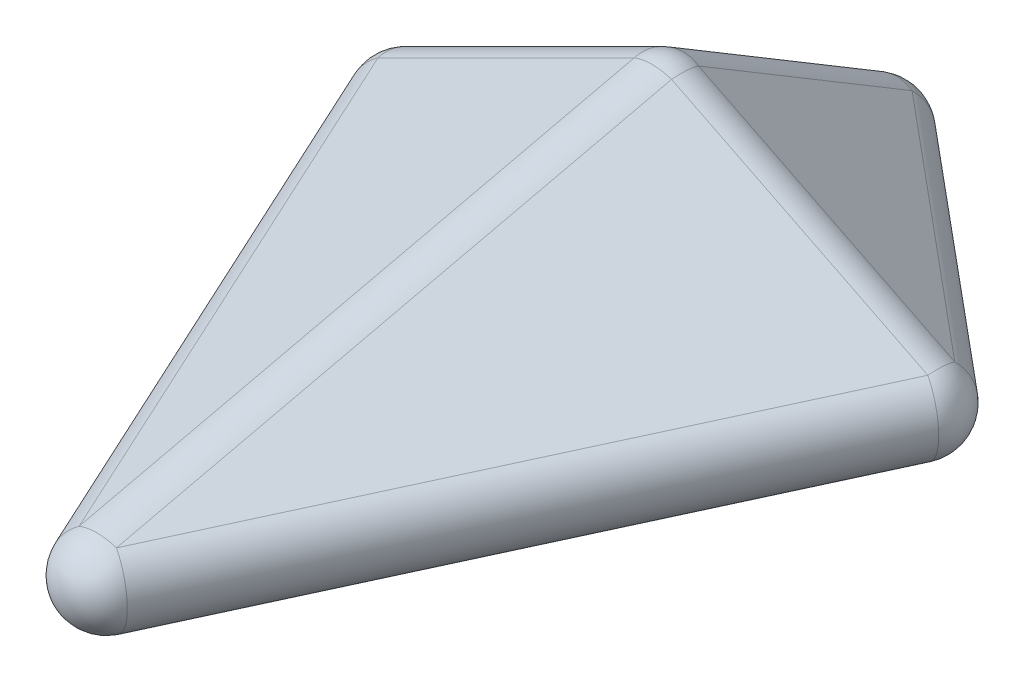
ISO-10303-21;
HEADER;
FILE_DESCRIPTION(('STEP AP214'),'2;1');
FILE_NAME('part.step','',(''),(''),'','','');
FILE_SCHEMA(('AUTOMOTIVE_DESIGN { 1 0 10303 214 1 1 1 1 }'));
ENDSEC;
DATA;
#1=APPLICATION_CONTEXT('core data for automotive mechanical design processes');
#2=APPLICATION_PROTOCOL_DEFINITION('international standard','automotive_design',2000,#1);
#3=PRODUCT_CONTEXT('',#1,'mechanical');
#4=PRODUCT('Part','Part','',(#3));
#5=PRODUCT_RELATED_PRODUCT_CATEGORY('part','',(#4));
#6=PRODUCT_DEFINITION_FORMATION('','',#4);
#7=PRODUCT_DEFINITION_CONTEXT('part definition',#1,'design');
#8=PRODUCT_DEFINITION('design','',#6,#7);
#9=PRODUCT_DEFINITION_SHAPE('','',#8);
#10=(LENGTH_UNIT() NAMED_UNIT(*) SI_UNIT(.MILLI.,.METRE.));
#11=(NAMED_UNIT(*) PLANE_ANGLE_UNIT() SI_UNIT($,.RADIAN.));
#12=(NAMED_UNIT(*) SI_UNIT($,.STERADIAN.) SOLID_ANGLE_UNIT());
#13=UNCERTAINTY_MEASURE_WITH_UNIT(LENGTH_MEASURE(1.E-05),#10,'distance_accuracy_value','');
#14=(GEOMETRIC_REPRESENTATION_CONTEXT(3) GLOBAL_UNCERTAINTY_ASSIGNED_CONTEXT((#13)) GLOBAL_UNIT_ASSIGNED_CONTEXT((#10,
#11,#12)) REPRESENTATION_CONTEXT('',''));
#15=CARTESIAN_POINT('',(0.,0.,0.));
#16=DIRECTION('',(0.,0.,1.));
#17=DIRECTION('',(1.,0.,0.));
#18=AXIS2_PLACEMENT_3D('',#15,#16,#17);
#19=CARTESIAN_POINT('',(-177.732540056397,140.344288770225,346.44378338033));
#20=DIRECTION('',(-0.39405520311955,0.788110406239101,-0.47286624374346));
#21=DIRECTION('',(0.,0.514495755427526,0.857492925712544));
#22=AXIS2_PLACEMENT_3D('',#19,#20,#21);
#23=PLANE('',#22);
#24=DIRECTION('',(0.894427190999916,0.447213595499958,0.));
#25=VECTOR('',#24,1.);
#26=CARTESIAN_POINT('',(0.383625189944573,20.1175026339666,-2.3643312187173));
#27=LINE('',#26,#25);
#28=CARTESIAN_POINT('',(-31.9702760155978,3.94055203119549,-2.36433121871729));
#29=VERTEX_POINT('',#28);
#30=CARTESIAN_POINT('',(-1.9702760155978,18.9405520311954,-2.3643312187173));
#31=VERTEX_POINT('',#30);
#32=EDGE_CURVE('E60',#29,#31,#27,.T.);
#33=ORIENTED_EDGE('',*,*,#32,.T.);
#34=DIRECTION('',(0.,-0.514495755427526,-0.857492925712544));
#35=VECTOR('',#34,1.);
#36=CARTESIAN_POINT('',(-1.9702760155978,3.21618584899045,-28.571608189059));
#37=LINE('',#36,#35);
#38=CARTESIAN_POINT('',(-1.97027601559779,3.94055203119551,-27.3643312187173));
#39=VERTEX_POINT('',#38);
#40=EDGE_CURVE('E255',#31,#39,#37,.T.);
#41=ORIENTED_EDGE('',*,*,#40,.T.);
#42=DIRECTION('',(0.768221279597376,0.,-0.64018439966448));
#43=VECTOR('',#42,1.);
#44=CARTESIAN_POINT('',(-289.538881645765,3.94055203119553,212.276173473088));
#45=LINE('',#44,#43);
#46=EDGE_CURVE('E210',#39,#29,#45,.F.);
#47=ORIENTED_EDGE('',*,*,#46,.T.);
#48=EDGE_LOOP('',(#33,#41,#47));
#49=FACE_BOUND('',#48,.T.);
#50=ADVANCED_FACE('F37',(#49),#23,.T.);
#51=CARTESIAN_POINT('',(-177.732540056397,-94.9705115084293,346.44378338033));
#52=DIRECTION('',(-0.295656197994541,-0.886968593983624,-0.35478743759345));
#53=DIRECTION('',(0.,0.371390676354104,-0.928476690885259));
#54=AXIS2_PLACEMENT_3D('',#51,#52,#53);
#55=PLANE('',#54);
#56=DIRECTION('',(0.768221279597376,0.,-0.64018439966448));
#57=VECTOR('',#56,1.);
#58=CARTESIAN_POINT('',(-289.04688662014,-4.4348429699182,212.866567503839));
#59=LINE('',#58,#57);
#60=CARTESIAN_POINT('',(-31.4782809899727,-4.43484296991818,-1.77393718796715));
#61=VERTEX_POINT('',#60);
#62=CARTESIAN_POINT('',(-1.47828098997266,-4.43484296991817,-26.7739371879672));
#63=VERTEX_POINT('',#62);
#64=EDGE_CURVE('E203',#61,#63,#59,.T.);
#65=ORIENTED_EDGE('',*,*,#64,.T.);
#66=DIRECTION('',(0.,-0.371390676354104,0.928476690885259));
#67=VECTOR('',#66,1.);
#68=CARTESIAN_POINT('',(-1.47828098997274,-14.9878631566111,-0.391386721234837));
#69=LINE('',#68,#67);
#70=CARTESIAN_POINT('',(-1.47828098997274,-14.4348429699181,-1.7739371879672));
#71=VERTEX_POINT('',#70);
#72=EDGE_CURVE('E165',#63,#71,#69,.T.);
#73=ORIENTED_EDGE('',*,*,#72,.T.);
#74=DIRECTION('',(-0.948683298050514,0.316227766016838,0.));
#75=VECTOR('',#74,1.);
#76=CARTESIAN_POINT('',(-32.0113897256416,-4.25714005802852,-1.77393718796721));
#77=LINE('',#76,#75);
#78=EDGE_CURVE('E231',#71,#61,#77,.T.);
#79=ORIENTED_EDGE('',*,*,#78,.T.);
#80=EDGE_LOOP('',(#65,#73,#79));
#81=FACE_BOUND('',#80,.T.);
#82=ADVANCED_FACE('F300',(#81),#55,.T.);
#83=CARTESIAN_POINT('',(219.623560570026,69.5541623383291,264.184381235056));
#84=DIRECTION('',(0.437981128343986,-0.875962256687972,-0.202145136158763));
#85=DIRECTION('',(0.894427190999916,0.447213595499958,0.));
#86=AXIS2_PLACEMENT_3D('',#83,#84,#85);
#87=PLANE('',#86);
#88=DIRECTION('',(0.,0.224859506698758,-0.97439119569462));
#89=VECTOR('',#88,1.);
#90=CARTESIAN_POINT('',(-2.18990564171989,19.8451629760729,-1.00579832061622));
#91=LINE('',#90,#89);
#92=CARTESIAN_POINT('',(-2.18990564171997,4.37981128343983,66.0107256807937));
#93=VERTEX_POINT('',#92);
#94=CARTESIAN_POINT('',(-2.1899056417199,19.3798112834399,1.01072568079381));
#95=VERTEX_POINT('',#94);
#96=EDGE_CURVE('E46',#93,#95,#91,.T.);
#97=ORIENTED_EDGE('',*,*,#96,.T.);
#98=DIRECTION('',(0.894427190999916,0.447213595499958,0.));
#99=VECTOR('',#98,1.);
#100=CARTESIAN_POINT('',(-32.8458878970093,4.05182015579515,1.01072568079379));
#101=LINE('',#100,#99);
#102=CARTESIAN_POINT('',(-32.1899056417199,4.37981128343983,1.0107256807938));
#103=VERTEX_POINT('',#102);
#104=EDGE_CURVE('E11',#95,#103,#101,.F.);
#105=ORIENTED_EDGE('',*,*,#104,.T.);
#106=DIRECTION('',(-0.419058177461747,0.,-0.907959384500452));
#107=VECTOR('',#106,1.);
#108=CARTESIAN_POINT('',(112.165362245379,4.37981128343984,313.780472769509));
#109=LINE('',#108,#107);
#110=EDGE_CURVE('E214',#103,#93,#109,.F.);
#111=ORIENTED_EDGE('',*,*,#110,.T.);
#112=EDGE_LOOP('',(#97,#105,#111));
#113=FACE_BOUND('',#112,.T.);
#114=ADVANCED_FACE('F321',(#113),#87,.F.);
#115=CARTESIAN_POINT('',(103.439374315095,-0.912577845874646,317.807851814255));
#116=DIRECTION('',(0.312912531879412,0.938737595638237,-0.144421168559729));
#117=DIRECTION('',(-0.948683298050514,0.316227766016838,0.));
#118=AXIS2_PLACEMENT_3D('',#115,#116,#117);
#119=PLANE('',#118);
#120=DIRECTION('',(-0.419058177461747,0.,-0.907959384500452));
#121=VECTOR('',#120,1.);
#122=CARTESIAN_POINT('',(112.790705227702,-4.69368797819119,313.491852931514));
#123=LINE('',#122,#121);
#124=CARTESIAN_POINT('',(-1.56456265939707,-4.69368797819119,65.7221058427986));
#125=VERTEX_POINT('',#124);
#126=CARTESIAN_POINT('',(-31.564562659397,-4.69368797819119,0.722105842798748));
#127=VERTEX_POINT('',#126);
#128=EDGE_CURVE('E197',#125,#127,#123,.T.);
#129=ORIENTED_EDGE('',*,*,#128,.T.);
#130=DIRECTION('',(-0.948683298050514,0.316227766016838,0.));
#131=VECTOR('',#130,1.);
#132=CARTESIAN_POINT('',(0.0592343039632352,-15.2349536326446,0.722105842798693));
#133=LINE('',#132,#131);
#134=CARTESIAN_POINT('',(-1.56456265939706,-14.6936879781912,0.722105842798692));
#135=VERTEX_POINT('',#134);
#136=EDGE_CURVE('E240',#127,#135,#133,.F.);
#137=ORIENTED_EDGE('',*,*,#136,.T.);
#138=DIRECTION('',(0.,0.152057184253941,0.988371697650617));
#139=VECTOR('',#138,1.);
#140=CARTESIAN_POINT('',(-1.56456265939707,-4.18422537811778,69.0336127432758));
#141=LINE('',#140,#139);
#142=EDGE_CURVE('E238',#135,#125,#141,.T.);
#143=ORIENTED_EDGE('',*,*,#142,.T.);
#144=EDGE_LOOP('',(#129,#137,#143));
#145=FACE_BOUND('',#144,.T.);
#146=ADVANCED_FACE('F324',(#145),#119,.F.);
#147=CARTESIAN_POINT('',(180.765255366117,140.344288770225,348.97104613843));
#148=DIRECTION('',(-0.39405520311955,-0.788110406239101,0.47286624374346));
#149=DIRECTION('',(0.,-0.514495755427526,-0.857492925712544));
#150=AXIS2_PLACEMENT_3D('',#147,#148,#149);
#151=PLANE('',#150);
#152=DIRECTION('',(0.,-0.514495755427526,-0.857492925712544));
#153=VECTOR('',#152,1.);
#154=CARTESIAN_POINT('',(1.97027601559772,20.1603868316507,-0.331273217958627));
#155=LINE('',#154,#153);
#156=CARTESIAN_POINT('',(1.97027601559779,3.9405520311955,-27.3643312187173));
#157=VERTEX_POINT('',#156);
#158=CARTESIAN_POINT('',(1.97027601559771,18.9405520311955,-2.36433121871724));
#159=VERTEX_POINT('',#158);
#160=EDGE_CURVE('E246',#157,#159,#155,.F.);
#161=ORIENTED_EDGE('',*,*,#160,.T.);
#162=DIRECTION('',(0.894427190999916,-0.447213595499958,0.));
#163=VECTOR('',#162,1.);
#164=CARTESIAN_POINT('',(32.6262582708872,3.61256090355078,-2.36433121871727));
#165=LINE('',#164,#163);
#166=CARTESIAN_POINT('',(31.9702760155978,3.94055203119549,-2.36433121871725));
#167=VERTEX_POINT('',#166);
#168=EDGE_CURVE('E248',#159,#167,#165,.T.);
#169=ORIENTED_EDGE('',*,*,#168,.T.);
#170=DIRECTION('',(-0.768221279597376,0.,-0.64018439966448));
#171=VECTOR('',#170,1.);
#172=CARTESIAN_POINT('',(292.571596955485,3.94055203119548,214.803436231188));
#173=LINE('',#172,#171);
#174=EDGE_CURVE('E150',#167,#157,#173,.T.);
#175=ORIENTED_EDGE('',*,*,#174,.T.);
#176=EDGE_LOOP('',(#161,#169,#175));
#177=FACE_BOUND('',#176,.T.);
#178=ADVANCED_FACE('F327',(#177),#151,.F.);
#179=CARTESIAN_POINT('',(180.765255366117,-94.9705115084293,348.97104613843));
#180=DIRECTION('',(-0.295656197994541,0.886968593983624,0.354787437593449));
#181=DIRECTION('',(0.,-0.371390676354104,0.928476690885259));
#182=AXIS2_PLACEMENT_3D('',#179,#180,#181);
#183=PLANE('',#182);
#184=DIRECTION('',(-0.768221279597376,0.,-0.640184399664479));
#185=VECTOR('',#184,1.);
#186=CARTESIAN_POINT('',(292.07960192986,-4.43484296991814,215.393830261939));
#187=LINE('',#186,#185);
#188=CARTESIAN_POINT('',(1.47828098997266,-4.43484296991814,-26.7739371879672));
#189=VERTEX_POINT('',#188);
#190=CARTESIAN_POINT('',(31.4782809899726,-4.43484296991814,-1.77393718796726));
#191=VERTEX_POINT('',#190);
#192=EDGE_CURVE('E132',#189,#191,#187,.F.);
#193=ORIENTED_EDGE('',*,*,#192,.T.);
#194=DIRECTION('',(-0.948683298050514,-0.316227766016838,0.));
#195=VECTOR('',#194,1.);
#196=CARTESIAN_POINT('',(-0.145515973387585,-14.9761086243715,-1.77393718796719));
#197=LINE('',#196,#195);
#198=CARTESIAN_POINT('',(1.47828098997267,-14.4348429699181,-1.77393718796719));
#199=VERTEX_POINT('',#198);
#200=EDGE_CURVE('E135',#191,#199,#197,.T.);
#201=ORIENTED_EDGE('',*,*,#200,.T.);
#202=DIRECTION('',(0.,-0.371390676354104,0.928476690885259));
#203=VECTOR('',#202,1.);
#204=CARTESIAN_POINT('',(1.47828098997267,-4.01004958199498,-27.8359206577751));
#205=LINE('',#204,#203);
#206=EDGE_CURVE('E129',#199,#189,#205,.F.);
#207=ORIENTED_EDGE('',*,*,#206,.T.);
#208=EDGE_LOOP('',(#193,#201,#207));
#209=FACE_BOUND('',#208,.T.);
#210=ADVANCED_FACE('F131',(#209),#183,.F.);
#211=CARTESIAN_POINT('',(-295.522276845683,69.5541623383291,428.631599832314));
#212=DIRECTION('',(0.437981128343986,0.875962256687972,0.202145136158763));
#213=DIRECTION('',(-0.894427190999916,0.447213595499958,0.));
#214=AXIS2_PLACEMENT_3D('',#211,#212,#213);
#215=PLANE('',#214);
#216=DIRECTION('',(0.419058177461747,0.,-0.907959384500452));
#217=VECTOR('',#216,1.);
#218=CARTESIAN_POINT('',(-188.064078521036,4.37981128343987,478.227691366766));
#219=LINE('',#218,#217);
#220=CARTESIAN_POINT('',(2.18990564171995,4.37981128343988,66.0107256807937));
#221=VERTEX_POINT('',#220);
#222=CARTESIAN_POINT('',(32.1899056417199,4.37981128343988,1.0107256807938));
#223=VERTEX_POINT('',#222);
#224=EDGE_CURVE('E149',#221,#223,#219,.T.);
#225=ORIENTED_EDGE('',*,*,#224,.T.);
#226=DIRECTION('',(0.894427190999916,-0.447213595499958,0.));
#227=VECTOR('',#226,1.);
#228=CARTESIAN_POINT('',(-0.163995563822332,20.556761886211,1.01072568079388));
#229=LINE('',#228,#227);
#230=CARTESIAN_POINT('',(2.18990564171995,19.3798112834398,1.01072568079388));
#231=VERTEX_POINT('',#230);
#232=EDGE_CURVE('E252',#223,#231,#229,.F.);
#233=ORIENTED_EDGE('',*,*,#232,.T.);
#234=DIRECTION('',(0.,0.224859506698758,-0.97439119569462));
#235=VECTOR('',#234,1.);
#236=CARTESIAN_POINT('',(2.18990564171996,3.34022124565713,70.515615844519));
#237=LINE('',#236,#235);
#238=EDGE_CURVE('E250',#231,#221,#237,.F.);
#239=ORIENTED_EDGE('',*,*,#238,.T.);
#240=EDGE_LOOP('',(#225,#233,#239));
#241=FACE_BOUND('',#240,.T.);
#242=ADVANCED_FACE('F332',(#241),#215,.T.);
#243=CARTESIAN_POINT('',(-179.338090590752,-0.912577845874646,482.255070411513));
#244=DIRECTION('',(0.312912531879412,-0.938737595638237,0.144421168559729));
#245=DIRECTION('',(0.948683298050514,0.316227766016838,0.));
#246=AXIS2_PLACEMENT_3D('',#243,#244,#245);
#247=PLANE('',#246);
#248=DIRECTION('',(0.,0.152057184253941,0.988371697650617));
#249=VECTOR('',#248,1.);
#250=CARTESIAN_POINT('',(1.56456265939706,-14.9031939444608,-0.639682937954016));
#251=LINE('',#250,#249);
#252=CARTESIAN_POINT('',(1.56456265939708,-4.69368797819118,65.7221058427986));
#253=VERTEX_POINT('',#252);
#254=CARTESIAN_POINT('',(1.56456265939706,-14.6936879781912,0.722105842798704));
#255=VERTEX_POINT('',#254);
#256=EDGE_CURVE('E222',#253,#255,#251,.F.);
#257=ORIENTED_EDGE('',*,*,#256,.T.);
#258=DIRECTION('',(-0.948683298050514,-0.316227766016838,0.));
#259=VECTOR('',#258,1.);
#260=CARTESIAN_POINT('',(32.0976713950659,-4.51598506630156,0.722105842798691));
#261=LINE('',#260,#259);
#262=CARTESIAN_POINT('',(31.5645626593971,-4.69368797819117,0.722105842798582));
#263=VERTEX_POINT('',#262);
#264=EDGE_CURVE('E224',#255,#263,#261,.F.);
#265=ORIENTED_EDGE('',*,*,#264,.T.);
#266=DIRECTION('',(0.419058177461747,0.,-0.907959384500452));
#267=VECTOR('',#266,1.);
#268=CARTESIAN_POINT('',(-188.689421503359,-4.69368797819121,477.939071528771));
#269=LINE('',#268,#267);
#270=EDGE_CURVE('E139',#263,#253,#269,.F.);
#271=ORIENTED_EDGE('',*,*,#270,.T.);
#272=EDGE_LOOP('',(#257,#265,#271));
#273=FACE_BOUND('',#272,.T.);
#274=ADVANCED_FACE('F278',(#273),#247,.T.);
#275=CARTESIAN_POINT('',(290.601320939887,0.,217.167767449906));
#276=DIRECTION('',(-0.768221279597376,0.,-0.640184399664479));
#277=DIRECTION('',(-0.64018439966448,0.,0.768221279597376));
#278=AXIS2_PLACEMENT_3D('',#275,#276,#277);
#279=CYLINDRICAL_SURFACE('',#278,5.);
#280=ORIENTED_EDGE('',*,*,#174,.F.);
#281=CARTESIAN_POINT('',(29.9999999999999,0.,0.));
#282=DIRECTION('',(-0.768221279597376,0.,-0.640184399664479));
#283=DIRECTION('',(-0.64018439966448,0.,0.768221279597376));
#284=AXIS2_PLACEMENT_3D('',#281,#282,#283);
#285=CIRCLE('',#284,5.);
#286=EDGE_CURVE('E148',#167,#191,#285,.T.);
#287=ORIENTED_EDGE('',*,*,#286,.T.);
#288=ORIENTED_EDGE('',*,*,#192,.F.);
#289=CARTESIAN_POINT('',(0.,0.,-24.9999999999999));
#290=DIRECTION('',(-0.768221279597376,0.,-0.640184399664479));
#291=DIRECTION('',(-0.64018439966448,0.,0.768221279597376));
#292=AXIS2_PLACEMENT_3D('',#289,#290,#291);
#293=CIRCLE('',#292,5.);
#294=EDGE_CURVE('E145',#189,#157,#293,.F.);
#295=ORIENTED_EDGE('',*,*,#294,.T.);
#296=EDGE_LOOP('',(#280,#287,#288,#295));
#297=FACE_BOUND('',#296,.T.);
#298=ADVANCED_FACE('F144',(#297),#279,.T.);
#299=CARTESIAN_POINT('',(-190.253984162756,0.,477.216965685972));
#300=DIRECTION('',(0.419058177461747,0.,-0.907959384500452));
#301=DIRECTION('',(-0.907959384500452,0.,-0.419058177461747));
#302=AXIS2_PLACEMENT_3D('',#299,#300,#301);
#303=CYLINDRICAL_SURFACE('',#302,5.);
#304=ORIENTED_EDGE('',*,*,#270,.F.);
#305=CARTESIAN_POINT('',(29.9999999999999,0.,0.));
#306=DIRECTION('',(0.419058177461747,0.,-0.907959384500452));
#307=DIRECTION('',(-0.907959384500452,0.,-0.419058177461747));
#308=AXIS2_PLACEMENT_3D('',#305,#306,#307);
#309=CIRCLE('',#308,5.);
#310=EDGE_CURVE('E161',#263,#223,#309,.F.);
#311=ORIENTED_EDGE('',*,*,#310,.T.);
#312=ORIENTED_EDGE('',*,*,#224,.F.);
#313=CARTESIAN_POINT('',(0.,0.,65.));
#314=DIRECTION('',(0.419058177461747,0.,-0.907959384500452));
#315=DIRECTION('',(-0.907959384500452,0.,-0.419058177461747));
#316=AXIS2_PLACEMENT_3D('',#313,#314,#315);
#317=CIRCLE('',#316,5.);
#318=EDGE_CURVE('E227',#221,#253,#317,.T.);
#319=ORIENTED_EDGE('',*,*,#318,.T.);
#320=EDGE_LOOP('',(#304,#311,#312,#319));
#321=FACE_BOUND('',#320,.T.);
#322=ADVANCED_FACE('F282',(#321),#303,.T.);
#323=CARTESIAN_POINT('',(-287.568605630167,0.,214.640504691806));
#324=DIRECTION('',(0.768221279597376,0.,-0.64018439966448));
#325=DIRECTION('',(-0.64018439966448,0.,-0.768221279597376));
#326=AXIS2_PLACEMENT_3D('',#323,#324,#325);
#327=CYLINDRICAL_SURFACE('',#326,5.);
#328=ORIENTED_EDGE('',*,*,#46,.F.);
#329=CARTESIAN_POINT('',(0.,0.,-25.));
#330=DIRECTION('',(0.768221279597376,0.,-0.64018439966448));
#331=DIRECTION('',(-0.64018439966448,0.,-0.768221279597376));
#332=AXIS2_PLACEMENT_3D('',#329,#330,#331);
#333=CIRCLE('',#332,5.);
#334=EDGE_CURVE('E236',#39,#63,#333,.F.);
#335=ORIENTED_EDGE('',*,*,#334,.T.);
#336=ORIENTED_EDGE('',*,*,#64,.F.);
#337=CARTESIAN_POINT('',(-30.,0.,0.));
#338=DIRECTION('',(0.768221279597376,0.,-0.64018439966448));
#339=DIRECTION('',(-0.64018439966448,0.,-0.768221279597376));
#340=AXIS2_PLACEMENT_3D('',#337,#338,#339);
#341=CIRCLE('',#340,5.);
#342=EDGE_CURVE('E234',#61,#29,#341,.T.);
#343=ORIENTED_EDGE('',*,*,#342,.T.);
#344=EDGE_LOOP('',(#328,#335,#336,#343));
#345=FACE_BOUND('',#344,.T.);
#346=ADVANCED_FACE('F303',(#345),#327,.T.);
#347=CARTESIAN_POINT('',(114.355267887099,0.,312.769747088715));
#348=DIRECTION('',(-0.419058177461747,0.,-0.907959384500452));
#349=DIRECTION('',(-0.907959384500452,0.,0.419058177461747));
#350=AXIS2_PLACEMENT_3D('',#347,#348,#349);
#351=CYLINDRICAL_SURFACE('',#350,5.);
#352=ORIENTED_EDGE('',*,*,#110,.F.);
#353=CARTESIAN_POINT('',(-30.,0.,0.));
#354=DIRECTION('',(-0.419058177461747,0.,-0.907959384500452));
#355=DIRECTION('',(-0.907959384500452,0.,0.419058177461747));
#356=AXIS2_PLACEMENT_3D('',#353,#354,#355);
#357=CIRCLE('',#356,5.);
#358=EDGE_CURVE('E244',#103,#127,#357,.F.);
#359=ORIENTED_EDGE('',*,*,#358,.T.);
#360=ORIENTED_EDGE('',*,*,#128,.F.);
#361=CARTESIAN_POINT('',(0.,0.,65.));
#362=DIRECTION('',(-0.419058177461747,0.,-0.907959384500452));
#363=DIRECTION('',(-0.907959384500452,0.,0.419058177461747));
#364=AXIS2_PLACEMENT_3D('',#361,#362,#363);
#365=CIRCLE('',#364,5.);
#366=EDGE_CURVE('E242',#125,#93,#365,.T.);
#367=ORIENTED_EDGE('',*,*,#366,.T.);
#368=EDGE_LOOP('',(#352,#359,#360,#367));
#369=FACE_BOUND('',#368,.T.);
#370=ADVANCED_FACE('F307',(#369),#351,.T.);
#371=CARTESIAN_POINT('',(-92.0483165370272,-31.0241582685136,0.));
#372=DIRECTION('',(-0.894427190999916,-0.447213595499958,0.));
#373=DIRECTION('',(0.447213595499958,-0.894427190999916,0.));
#374=AXIS2_PLACEMENT_3D('',#371,#372,#373);
#375=CYLINDRICAL_SURFACE('',#374,5.);
#376=CARTESIAN_POINT('',(-30.,0.,0.));
#377=DIRECTION('',(-0.894427190999916,-0.447213595499958,0.));
#378=DIRECTION('',(0.447213595499958,-0.894427190999916,0.));
#379=AXIS2_PLACEMENT_3D('',#376,#377,#378);
#380=CIRCLE('',#379,5.);
#381=EDGE_CURVE('E41',#103,#29,#380,.T.);
#382=ORIENTED_EDGE('',*,*,#381,.F.);
#383=ORIENTED_EDGE('',*,*,#104,.F.);
#384=CARTESIAN_POINT('',(0.,14.9999999999999,0.));
#385=DIRECTION('',(0.894427190999922,0.447213595499945,0.));
#386=DIRECTION('',(-0.447213595499945,0.894427190999922,0.));
#387=AXIS2_PLACEMENT_3D('',#384,#385,#386);
#388=CIRCLE('',#387,5.);
#389=EDGE_CURVE('E191',#31,#95,#388,.T.);
#390=ORIENTED_EDGE('',*,*,#389,.F.);
#391=ORIENTED_EDGE('',*,*,#32,.F.);
#392=EDGE_LOOP('',(#382,#383,#390,#391));
#393=FACE_BOUND('',#392,.T.);
#394=ADVANCED_FACE('F39',(#393),#375,.T.);
#395=CARTESIAN_POINT('',(0.,15.,0.));
#396=DIRECTION('',(0.,0.,1.));
#397=DIRECTION('',(1.,0.,0.));
#398=AXIS2_PLACEMENT_3D('',#395,#396,#397);
#399=SPHERICAL_SURFACE('',#398,5.);
#400=CARTESIAN_POINT('',(0.,15.,0.));
#401=DIRECTION('',(0.,0.224859506698766,-0.974391195694618));
#402=DIRECTION('',(0.,0.974391195694618,0.224859506698766));
#403=AXIS2_PLACEMENT_3D('',#400,#401,#402);
#404=CIRCLE('',#403,5.);
#405=EDGE_CURVE('E183',#231,#95,#404,.F.);
#406=ORIENTED_EDGE('',*,*,#405,.F.);
#407=CARTESIAN_POINT('',(0.,15.,0.));
#408=DIRECTION('',(-0.894427190999918,0.447213595499954,0.));
#409=DIRECTION('',(-0.447213595499954,-0.894427190999918,0.));
#410=AXIS2_PLACEMENT_3D('',#407,#408,#409);
#411=CIRCLE('',#410,5.);
#412=EDGE_CURVE('E189',#159,#231,#411,.F.);
#413=ORIENTED_EDGE('',*,*,#412,.F.);
#414=CARTESIAN_POINT('',(0.,15.,0.));
#415=DIRECTION('',(0.,0.514495755427534,0.85749292571254));
#416=DIRECTION('',(0.,-0.85749292571254,0.514495755427534));
#417=AXIS2_PLACEMENT_3D('',#414,#415,#416);
#418=CIRCLE('',#417,5.);
#419=EDGE_CURVE('E186',#31,#159,#418,.F.);
#420=ORIENTED_EDGE('',*,*,#419,.F.);
#421=ORIENTED_EDGE('',*,*,#389,.T.);
#422=EDGE_LOOP('',(#406,#413,#420,#421));
#423=FACE_BOUND('',#422,.T.);
#424=ADVANCED_FACE('F311',(#423),#399,.T.);
#425=CARTESIAN_POINT('',(94.4744887848032,-32.2372443924016,0.));
#426=DIRECTION('',(-0.894427190999916,0.447213595499958,0.));
#427=DIRECTION('',(-0.447213595499958,-0.894427190999916,0.));
#428=AXIS2_PLACEMENT_3D('',#425,#426,#427);
#429=CYLINDRICAL_SURFACE('',#428,5.);
#430=ORIENTED_EDGE('',*,*,#412,.T.);
#431=ORIENTED_EDGE('',*,*,#232,.F.);
#432=CARTESIAN_POINT('',(30.,0.,0.));
#433=DIRECTION('',(0.894427190999917,-0.447213595499955,0.));
#434=DIRECTION('',(0.447213595499955,0.894427190999917,0.));
#435=AXIS2_PLACEMENT_3D('',#432,#433,#434);
#436=CIRCLE('',#435,5.);
#437=EDGE_CURVE('E180',#167,#223,#436,.T.);
#438=ORIENTED_EDGE('',*,*,#437,.F.);
#439=ORIENTED_EDGE('',*,*,#168,.F.);
#440=EDGE_LOOP('',(#430,#431,#438,#439));
#441=FACE_BOUND('',#440,.T.);
#442=ADVANCED_FACE('F373',(#441),#429,.T.);
#443=CARTESIAN_POINT('',(0.,201.022216165793,310.037026942989));
#444=DIRECTION('',(0.,0.514495755427526,0.857492925712544));
#445=DIRECTION('',(0.,-0.857492925712544,0.514495755427526));
#446=AXIS2_PLACEMENT_3D('',#443,#444,#445);
#447=CYLINDRICAL_SURFACE('',#446,5.);
#448=ORIENTED_EDGE('',*,*,#419,.T.);
#449=ORIENTED_EDGE('',*,*,#160,.F.);
#450=CARTESIAN_POINT('',(0.,0.,-25.));
#451=DIRECTION('',(0.,-0.514495755427523,-0.857492925712547));
#452=DIRECTION('',(0.,0.857492925712547,-0.514495755427523));
#453=AXIS2_PLACEMENT_3D('',#450,#451,#452);
#454=CIRCLE('',#453,5.);
#455=EDGE_CURVE('E160',#39,#157,#454,.T.);
#456=ORIENTED_EDGE('',*,*,#455,.F.);
#457=ORIENTED_EDGE('',*,*,#40,.F.);
#458=EDGE_LOOP('',(#448,#449,#456,#457));
#459=FACE_BOUND('',#458,.T.);
#460=ADVANCED_FACE('F315',(#459),#447,.T.);
#461=CARTESIAN_POINT('',(-30.,0.,0.));
#462=DIRECTION('',(0.,0.,1.));
#463=DIRECTION('',(1.,0.,0.));
#464=AXIS2_PLACEMENT_3D('',#461,#462,#463);
#465=SPHERICAL_SURFACE('',#464,5.);
#466=ORIENTED_EDGE('',*,*,#381,.T.);
#467=ORIENTED_EDGE('',*,*,#342,.F.);
#468=CARTESIAN_POINT('',(-30.,0.,0.));
#469=DIRECTION('',(0.948683298050515,-0.316227766016834,0.));
#470=DIRECTION('',(0.316227766016834,0.948683298050515,0.));
#471=AXIS2_PLACEMENT_3D('',#468,#469,#470);
#472=CIRCLE('',#471,5.);
#473=EDGE_CURVE('E170',#127,#61,#472,.T.);
#474=ORIENTED_EDGE('',*,*,#473,.F.);
#475=ORIENTED_EDGE('',*,*,#358,.F.);
#476=EDGE_LOOP('',(#466,#467,#474,#475));
#477=FACE_BOUND('',#476,.T.);
#478=ADVANCED_FACE('F304',(#477),#465,.T.);
#479=CARTESIAN_POINT('',(0.,-40.1247382422598,238.873865716459));
#480=DIRECTION('',(0.,-0.224859506698758,0.97439119569462));
#481=DIRECTION('',(0.,-0.97439119569462,-0.224859506698758));
#482=AXIS2_PLACEMENT_3D('',#479,#480,#481);
#483=CYLINDRICAL_SURFACE('',#482,5.);
#484=ORIENTED_EDGE('',*,*,#405,.T.);
#485=ORIENTED_EDGE('',*,*,#96,.F.);
#486=CARTESIAN_POINT('',(0.,0.,64.9999999999999));
#487=DIRECTION('',(0.,-0.224859506698761,0.974391195694619));
#488=DIRECTION('',(0.,-0.974391195694619,-0.224859506698761));
#489=AXIS2_PLACEMENT_3D('',#486,#487,#488);
#490=CIRCLE('',#489,5.);
#491=EDGE_CURVE('E166',#221,#93,#490,.T.);
#492=ORIENTED_EDGE('',*,*,#491,.F.);
#493=ORIENTED_EDGE('',*,*,#238,.F.);
#494=EDGE_LOOP('',(#484,#485,#492,#493));
#495=FACE_BOUND('',#494,.T.);
#496=ADVANCED_FACE('F365',(#495),#483,.T.);
#497=CARTESIAN_POINT('',(0.,0.,-25.));
#498=DIRECTION('',(0.,0.,1.));
#499=DIRECTION('',(1.,0.,0.));
#500=AXIS2_PLACEMENT_3D('',#497,#498,#499);
#501=SPHERICAL_SURFACE('',#500,5.);
#502=ORIENTED_EDGE('',*,*,#455,.T.);
#503=ORIENTED_EDGE('',*,*,#294,.F.);
#504=CARTESIAN_POINT('',(0.,0.,-24.9999999999999));
#505=DIRECTION('',(0.,-0.371390676354106,0.928476690885259));
#506=DIRECTION('',(0.,-0.928476690885259,-0.371390676354106));
#507=AXIS2_PLACEMENT_3D('',#504,#505,#506);
#508=CIRCLE('',#507,5.);
#509=EDGE_CURVE('E157',#63,#189,#508,.T.);
#510=ORIENTED_EDGE('',*,*,#509,.F.);
#511=ORIENTED_EDGE('',*,*,#334,.F.);
#512=EDGE_LOOP('',(#502,#503,#510,#511));
#513=FACE_BOUND('',#512,.T.);
#514=ADVANCED_FACE('F155',(#513),#501,.T.);
#515=CARTESIAN_POINT('',(0.,0.,64.9999999999999));
#516=DIRECTION('',(0.,0.,1.));
#517=DIRECTION('',(1.,0.,0.));
#518=AXIS2_PLACEMENT_3D('',#515,#516,#517);
#519=SPHERICAL_SURFACE('',#518,5.);
#520=ORIENTED_EDGE('',*,*,#491,.T.);
#521=ORIENTED_EDGE('',*,*,#366,.F.);
#522=CARTESIAN_POINT('',(0.,0.,64.9999999999998));
#523=DIRECTION('',(0.,-0.152057184253961,-0.988371697650614));
#524=DIRECTION('',(0.,0.988371697650614,-0.152057184253961));
#525=AXIS2_PLACEMENT_3D('',#522,#523,#524);
#526=CIRCLE('',#525,5.);
#527=EDGE_CURVE('E167',#253,#125,#526,.T.);
#528=ORIENTED_EDGE('',*,*,#527,.F.);
#529=ORIENTED_EDGE('',*,*,#318,.F.);
#530=EDGE_LOOP('',(#520,#521,#528,#529));
#531=FACE_BOUND('',#530,.T.);
#532=ADVANCED_FACE('F286',(#531),#519,.T.);
#533=CARTESIAN_POINT('',(29.9999999999999,0.,0.));
#534=DIRECTION('',(0.,0.,1.));
#535=DIRECTION('',(1.,0.,0.));
#536=AXIS2_PLACEMENT_3D('',#533,#534,#535);
#537=SPHERICAL_SURFACE('',#536,5.);
#538=ORIENTED_EDGE('',*,*,#437,.T.);
#539=ORIENTED_EDGE('',*,*,#310,.F.);
#540=CARTESIAN_POINT('',(30.,0.,0.));
#541=DIRECTION('',(-0.948683298050514,-0.316227766016837,0.));
#542=DIRECTION('',(0.316227766016837,-0.948683298050514,0.));
#543=AXIS2_PLACEMENT_3D('',#540,#541,#542);
#544=CIRCLE('',#543,5.);
#545=EDGE_CURVE('E173',#191,#263,#544,.T.);
#546=ORIENTED_EDGE('',*,*,#545,.F.);
#547=ORIENTED_EDGE('',*,*,#286,.F.);
#548=EDGE_LOOP('',(#538,#539,#546,#547));
#549=FACE_BOUND('',#548,.T.);
#550=ADVANCED_FACE('F272',(#549),#537,.T.);
#551=CARTESIAN_POINT('',(0.,-141.183444132311,327.958610330778));
#552=DIRECTION('',(0.,0.371390676354104,-0.928476690885259));
#553=DIRECTION('',(0.,0.928476690885259,0.371390676354104));
#554=AXIS2_PLACEMENT_3D('',#551,#552,#553);
#555=CYLINDRICAL_SURFACE('',#554,5.);
#556=ORIENTED_EDGE('',*,*,#509,.T.);
#557=ORIENTED_EDGE('',*,*,#206,.F.);
#558=CARTESIAN_POINT('',(0.,-10.,0.));
#559=DIRECTION('',(0.,-0.371390676354103,0.92847669088526));
#560=DIRECTION('',(0.,-0.92847669088526,-0.371390676354103));
#561=AXIS2_PLACEMENT_3D('',#558,#559,#560);
#562=CIRCLE('',#561,5.);
#563=EDGE_CURVE('E264',#71,#199,#562,.T.);
#564=ORIENTED_EDGE('',*,*,#563,.F.);
#565=ORIENTED_EDGE('',*,*,#72,.F.);
#566=EDGE_LOOP('',(#556,#557,#564,#565));
#567=FACE_BOUND('',#566,.T.);
#568=ADVANCED_FACE('F163',(#567),#555,.T.);
#569=CARTESIAN_POINT('',(-134.468132598228,34.822710866076,0.));
#570=DIRECTION('',(0.948683298050514,-0.316227766016838,0.));
#571=DIRECTION('',(0.316227766016838,0.948683298050514,0.));
#572=AXIS2_PLACEMENT_3D('',#569,#570,#571);
#573=CYLINDRICAL_SURFACE('',#572,5.);
#574=ORIENTED_EDGE('',*,*,#473,.T.);
#575=ORIENTED_EDGE('',*,*,#78,.F.);
#576=CARTESIAN_POINT('',(0.,-9.99999999999999,0.));
#577=DIRECTION('',(0.948683298050513,-0.316227766016839,0.));
#578=DIRECTION('',(0.316227766016839,0.948683298050513,0.));
#579=AXIS2_PLACEMENT_3D('',#576,#577,#578);
#580=CIRCLE('',#579,5.);
#581=EDGE_CURVE('E262',#135,#71,#580,.T.);
#582=ORIENTED_EDGE('',*,*,#581,.F.);
#583=ORIENTED_EDGE('',*,*,#136,.F.);
#584=EDGE_LOOP('',(#574,#575,#582,#583));
#585=FACE_BOUND('',#584,.T.);
#586=ADVANCED_FACE('F297',(#585),#573,.T.);
#587=CARTESIAN_POINT('',(0.,37.9731435594632,311.825433136511));
#588=DIRECTION('',(0.,-0.152057184253941,-0.988371697650617));
#589=DIRECTION('',(0.,0.988371697650617,-0.152057184253941));
#590=AXIS2_PLACEMENT_3D('',#587,#588,#589);
#591=CYLINDRICAL_SURFACE('',#590,5.);
#592=ORIENTED_EDGE('',*,*,#527,.T.);
#593=ORIENTED_EDGE('',*,*,#142,.F.);
#594=CARTESIAN_POINT('',(0.,-9.99999999999998,0.));
#595=DIRECTION('',(0.,-0.15205718425394,-0.988371697650617));
#596=DIRECTION('',(0.,0.988371697650617,-0.15205718425394));
#597=AXIS2_PLACEMENT_3D('',#594,#595,#596);
#598=CIRCLE('',#597,5.);
#599=EDGE_CURVE('E260',#255,#135,#598,.T.);
#600=ORIENTED_EDGE('',*,*,#599,.F.);
#601=ORIENTED_EDGE('',*,*,#256,.F.);
#602=EDGE_LOOP('',(#592,#593,#600,#601));
#603=FACE_BOUND('',#602,.T.);
#604=ADVANCED_FACE('F290',(#603),#591,.T.);
#605=CARTESIAN_POINT('',(0.,-10.,0.));
#606=DIRECTION('',(0.,0.,1.));
#607=DIRECTION('',(1.,0.,0.));
#608=AXIS2_PLACEMENT_3D('',#605,#606,#607);
#609=SPHERICAL_SURFACE('',#608,5.);
#610=ORIENTED_EDGE('',*,*,#581,.T.);
#611=ORIENTED_EDGE('',*,*,#563,.T.);
#612=CARTESIAN_POINT('',(0.,-10.,0.));
#613=DIRECTION('',(-0.948683298050512,-0.316227766016843,0.));
#614=DIRECTION('',(0.316227766016843,-0.948683298050512,0.));
#615=AXIS2_PLACEMENT_3D('',#612,#613,#614);
#616=CIRCLE('',#615,5.);
#617=EDGE_CURVE('E258',#255,#199,#616,.F.);
#618=ORIENTED_EDGE('',*,*,#617,.F.);
#619=ORIENTED_EDGE('',*,*,#599,.T.);
#620=EDGE_LOOP('',(#610,#611,#618,#619));
#621=FACE_BOUND('',#620,.T.);
#622=ADVANCED_FACE('F293',(#621),#609,.T.);
#623=CARTESIAN_POINT('',(137.197576376976,35.732525458992,0.));
#624=DIRECTION('',(0.948683298050514,0.316227766016838,0.));
#625=DIRECTION('',(-0.316227766016838,0.948683298050514,0.));
#626=AXIS2_PLACEMENT_3D('',#623,#624,#625);
#627=CYLINDRICAL_SURFACE('',#626,5.);
#628=ORIENTED_EDGE('',*,*,#545,.T.);
#629=ORIENTED_EDGE('',*,*,#264,.F.);
#630=ORIENTED_EDGE('',*,*,#617,.T.);
#631=ORIENTED_EDGE('',*,*,#200,.F.);
#632=EDGE_LOOP('',(#628,#629,#630,#631));
#633=FACE_BOUND('',#632,.T.);
#634=ADVANCED_FACE('F269',(#633),#627,.T.);
#635=CLOSED_SHELL('',(#50,#82,#114,#146,#178,#210,#242,#274,#298,#322,#346,#370,#394,#424,#442,
#460,#478,#496,#514,#532,#550,#568,#586,#604,#622,#634));
#636=MANIFOLD_SOLID_BREP('B2',#635);
#637=ADVANCED_BREP_SHAPE_REPRESENTATION('',(#18,#636),#14);
#638=SHAPE_DEFINITION_REPRESENTATION(#9,#637);
ENDSEC;
END-ISO-10303-21;
